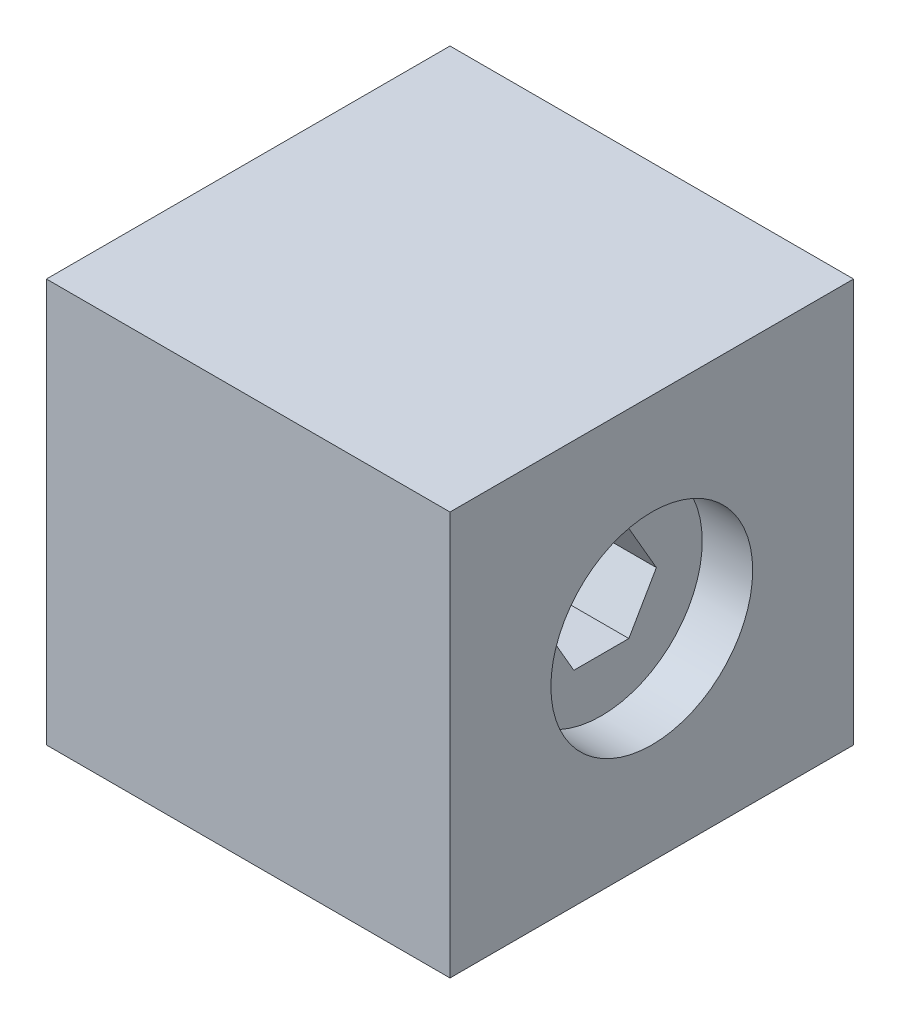
ISO-10303-21;
HEADER;
FILE_DESCRIPTION(('STEP AP214'),'2;1');
FILE_NAME('part.step','',(''),(''),'','','');
FILE_SCHEMA(('AUTOMOTIVE_DESIGN { 1 0 10303 214 1 1 1 1 }'));
ENDSEC;
DATA;
#1=APPLICATION_CONTEXT('core data for automotive mechanical design processes');
#2=APPLICATION_PROTOCOL_DEFINITION('international standard','automotive_design',2000,#1);
#3=PRODUCT_CONTEXT('',#1,'mechanical');
#4=PRODUCT('Part','Part','',(#3));
#5=PRODUCT_RELATED_PRODUCT_CATEGORY('part','',(#4));
#6=PRODUCT_DEFINITION_FORMATION('','',#4);
#7=PRODUCT_DEFINITION_CONTEXT('part definition',#1,'design');
#8=PRODUCT_DEFINITION('design','',#6,#7);
#9=PRODUCT_DEFINITION_SHAPE('','',#8);
#10=(LENGTH_UNIT() NAMED_UNIT(*) SI_UNIT(.MILLI.,.METRE.));
#11=(NAMED_UNIT(*) PLANE_ANGLE_UNIT() SI_UNIT($,.RADIAN.));
#12=(NAMED_UNIT(*) SI_UNIT($,.STERADIAN.) SOLID_ANGLE_UNIT());
#13=UNCERTAINTY_MEASURE_WITH_UNIT(LENGTH_MEASURE(1.E-05),#10,'distance_accuracy_value','');
#14=(GEOMETRIC_REPRESENTATION_CONTEXT(3) GLOBAL_UNCERTAINTY_ASSIGNED_CONTEXT((#13)) GLOBAL_UNIT_ASSIGNED_CONTEXT((#10,
#11,#12)) REPRESENTATION_CONTEXT('',''));
#15=CARTESIAN_POINT('',(0.,0.,0.));
#16=DIRECTION('',(0.,0.,1.));
#17=DIRECTION('',(1.,0.,0.));
#18=AXIS2_PLACEMENT_3D('',#15,#16,#17);
#19=CARTESIAN_POINT('',(-25.4,19.4,-3.46410161513776));
#20=DIRECTION('',(0.,-0.5,-0.866025403784438));
#21=DIRECTION('',(0.,0.866025403784439,-0.5));
#22=AXIS2_PLACEMENT_3D('',#19,#20,#21);
#23=PLANE('',#22);
#24=DIRECTION('',(0.,-0.866025403784439,0.5));
#25=VECTOR('',#24,1.);
#26=CARTESIAN_POINT('',(19.05,19.4,-3.46410161513776));
#27=LINE('',#26,#25);
#28=CARTESIAN_POINT('',(19.05,25.4,-6.92820323027552));
#29=VERTEX_POINT('',#28);
#30=CARTESIAN_POINT('',(19.05,19.4,-3.46410161513776));
#31=VERTEX_POINT('',#30);
#32=EDGE_CURVE('E158',#29,#31,#27,.T.);
#33=ORIENTED_EDGE('',*,*,#32,.F.);
#34=DIRECTION('',(1.,0.,0.));
#35=VECTOR('',#34,1.);
#36=CARTESIAN_POINT('',(-25.4,25.4,-6.92820323027552));
#37=LINE('',#36,#35);
#38=CARTESIAN_POINT('',(-25.4,25.4,-6.92820323027552));
#39=VERTEX_POINT('',#38);
#40=EDGE_CURVE('E165',#39,#29,#37,.T.);
#41=ORIENTED_EDGE('',*,*,#40,.F.);
#42=DIRECTION('',(0.,0.866025403784438,-0.5));
#43=VECTOR('',#42,1.);
#44=CARTESIAN_POINT('',(-25.4,19.4,-3.46410161513776));
#45=LINE('',#44,#43);
#46=CARTESIAN_POINT('',(-25.4,19.4,-3.46410161513776));
#47=VERTEX_POINT('',#46);
#48=EDGE_CURVE('E168',#47,#39,#45,.T.);
#49=ORIENTED_EDGE('',*,*,#48,.F.);
#50=DIRECTION('',(1.,0.,0.));
#51=VECTOR('',#50,1.);
#52=CARTESIAN_POINT('',(-25.4,19.4,-3.46410161513776));
#53=LINE('',#52,#51);
#54=EDGE_CURVE('E167',#47,#31,#53,.T.);
#55=ORIENTED_EDGE('',*,*,#54,.T.);
#56=EDGE_LOOP('',(#33,#41,#49,#55));
#57=FACE_BOUND('',#56,.T.);
#58=ADVANCED_FACE('F34',(#57),#23,.F.);
#59=CARTESIAN_POINT('',(-25.4,19.4,3.46410161513776));
#60=DIRECTION('',(0.,-1.,0.));
#61=DIRECTION('',(0.,0.,-1.));
#62=AXIS2_PLACEMENT_3D('',#59,#60,#61);
#63=PLANE('',#62);
#64=DIRECTION('',(0.,0.,1.));
#65=VECTOR('',#64,1.);
#66=CARTESIAN_POINT('',(19.05,19.4,3.46410161513776));
#67=LINE('',#66,#65);
#68=CARTESIAN_POINT('',(19.05,19.4,3.46410161513776));
#69=VERTEX_POINT('',#68);
#70=EDGE_CURVE('E169',#31,#69,#67,.T.);
#71=ORIENTED_EDGE('',*,*,#70,.F.);
#72=ORIENTED_EDGE('',*,*,#54,.F.);
#73=DIRECTION('',(0.,0.,-1.));
#74=VECTOR('',#73,1.);
#75=CARTESIAN_POINT('',(-25.4,19.4,3.46410161513776));
#76=LINE('',#75,#74);
#77=CARTESIAN_POINT('',(-25.4,19.4,3.46410161513776));
#78=VERTEX_POINT('',#77);
#79=EDGE_CURVE('E176',#78,#47,#76,.T.);
#80=ORIENTED_EDGE('',*,*,#79,.F.);
#81=DIRECTION('',(1.,0.,0.));
#82=VECTOR('',#81,1.);
#83=CARTESIAN_POINT('',(-25.4,19.4,3.46410161513776));
#84=LINE('',#83,#82);
#85=EDGE_CURVE('E553',#78,#69,#84,.T.);
#86=ORIENTED_EDGE('',*,*,#85,.T.);
#87=EDGE_LOOP('',(#71,#72,#80,#86));
#88=FACE_BOUND('',#87,.T.);
#89=ADVANCED_FACE('F311',(#88),#63,.F.);
#90=CARTESIAN_POINT('',(-25.4,25.4,6.92820323027552));
#91=DIRECTION('',(0.,-0.5,0.866025403784439));
#92=DIRECTION('',(0.,-0.866025403784439,-0.5));
#93=AXIS2_PLACEMENT_3D('',#90,#91,#92);
#94=PLANE('',#93);
#95=DIRECTION('',(0.,0.866025403784439,0.5));
#96=VECTOR('',#95,1.);
#97=CARTESIAN_POINT('',(19.05,25.4,6.92820323027552));
#98=LINE('',#97,#96);
#99=CARTESIAN_POINT('',(19.05,25.4,6.92820323027552));
#100=VERTEX_POINT('',#99);
#101=EDGE_CURVE('E541',#69,#100,#98,.T.);
#102=ORIENTED_EDGE('',*,*,#101,.F.);
#103=ORIENTED_EDGE('',*,*,#85,.F.);
#104=DIRECTION('',(0.,-0.866025403784439,-0.5));
#105=VECTOR('',#104,1.);
#106=CARTESIAN_POINT('',(-25.4,25.4,6.92820323027552));
#107=LINE('',#106,#105);
#108=CARTESIAN_POINT('',(-25.4,25.4,6.92820323027552));
#109=VERTEX_POINT('',#108);
#110=EDGE_CURVE('E181',#109,#78,#107,.T.);
#111=ORIENTED_EDGE('',*,*,#110,.F.);
#112=DIRECTION('',(1.,0.,0.));
#113=VECTOR('',#112,1.);
#114=CARTESIAN_POINT('',(-25.4,25.4,6.92820323027552));
#115=LINE('',#114,#113);
#116=EDGE_CURVE('E556',#109,#100,#115,.T.);
#117=ORIENTED_EDGE('',*,*,#116,.T.);
#118=EDGE_LOOP('',(#102,#103,#111,#117));
#119=FACE_BOUND('',#118,.T.);
#120=ADVANCED_FACE('F316',(#119),#94,.F.);
#121=CARTESIAN_POINT('',(-25.4,31.4,3.46410161513776));
#122=DIRECTION('',(0.,0.5,0.866025403784439));
#123=DIRECTION('',(0.,-0.866025403784439,0.5));
#124=AXIS2_PLACEMENT_3D('',#121,#122,#123);
#125=PLANE('',#124);
#126=DIRECTION('',(0.,0.866025403784439,-0.5));
#127=VECTOR('',#126,1.);
#128=CARTESIAN_POINT('',(19.05,31.4,3.46410161513776));
#129=LINE('',#128,#127);
#130=CARTESIAN_POINT('',(19.05,31.4,3.46410161513776));
#131=VERTEX_POINT('',#130);
#132=EDGE_CURVE('E539',#100,#131,#129,.T.);
#133=ORIENTED_EDGE('',*,*,#132,.F.);
#134=ORIENTED_EDGE('',*,*,#116,.F.);
#135=DIRECTION('',(0.,-0.866025403784439,0.5));
#136=VECTOR('',#135,1.);
#137=CARTESIAN_POINT('',(-25.4,31.4,3.46410161513776));
#138=LINE('',#137,#136);
#139=CARTESIAN_POINT('',(-25.4,31.4,3.46410161513776));
#140=VERTEX_POINT('',#139);
#141=EDGE_CURVE('E547',#140,#109,#138,.T.);
#142=ORIENTED_EDGE('',*,*,#141,.F.);
#143=DIRECTION('',(1.,0.,0.));
#144=VECTOR('',#143,1.);
#145=CARTESIAN_POINT('',(-25.4,31.4,3.46410161513776));
#146=LINE('',#145,#144);
#147=EDGE_CURVE('E178',#140,#131,#146,.T.);
#148=ORIENTED_EDGE('',*,*,#147,.T.);
#149=EDGE_LOOP('',(#133,#134,#142,#148));
#150=FACE_BOUND('',#149,.T.);
#151=ADVANCED_FACE('F444',(#150),#125,.F.);
#152=CARTESIAN_POINT('',(-25.4,31.4,-3.46410161513777));
#153=DIRECTION('',(0.,1.,0.));
#154=DIRECTION('',(0.,0.,1.));
#155=AXIS2_PLACEMENT_3D('',#152,#153,#154);
#156=PLANE('',#155);
#157=DIRECTION('',(0.,0.,-1.));
#158=VECTOR('',#157,1.);
#159=CARTESIAN_POINT('',(19.05,31.4,-3.46410161513777));
#160=LINE('',#159,#158);
#161=CARTESIAN_POINT('',(19.05,31.4,-3.46410161513777));
#162=VERTEX_POINT('',#161);
#163=EDGE_CURVE('E48',#131,#162,#160,.T.);
#164=ORIENTED_EDGE('',*,*,#163,.F.);
#165=ORIENTED_EDGE('',*,*,#147,.F.);
#166=DIRECTION('',(0.,0.,1.));
#167=VECTOR('',#166,1.);
#168=CARTESIAN_POINT('',(-25.4,31.4,-3.46410161513777));
#169=LINE('',#168,#167);
#170=CARTESIAN_POINT('',(-25.4,31.4,-3.46410161513776));
#171=VERTEX_POINT('',#170);
#172=EDGE_CURVE('E56',#171,#140,#169,.T.);
#173=ORIENTED_EDGE('',*,*,#172,.F.);
#174=DIRECTION('',(1.,0.,0.));
#175=VECTOR('',#174,1.);
#176=CARTESIAN_POINT('',(-25.4,31.4,-3.46410161513777));
#177=LINE('',#176,#175);
#178=EDGE_CURVE('E175',#171,#162,#177,.T.);
#179=ORIENTED_EDGE('',*,*,#178,.T.);
#180=EDGE_LOOP('',(#164,#165,#173,#179));
#181=FACE_BOUND('',#180,.T.);
#182=ADVANCED_FACE('F453',(#181),#156,.F.);
#183=CARTESIAN_POINT('',(-25.4,25.4,-6.92820323027552));
#184=DIRECTION('',(0.,0.5,-0.866025403784439));
#185=DIRECTION('',(0.,0.866025403784439,0.5));
#186=AXIS2_PLACEMENT_3D('',#183,#184,#185);
#187=PLANE('',#186);
#188=DIRECTION('',(0.,-0.866025403784439,-0.5));
#189=VECTOR('',#188,1.);
#190=CARTESIAN_POINT('',(19.05,25.4,-6.92820323027552));
#191=LINE('',#190,#189);
#192=EDGE_CURVE('E11',#162,#29,#191,.T.);
#193=ORIENTED_EDGE('',*,*,#192,.F.);
#194=ORIENTED_EDGE('',*,*,#178,.F.);
#195=DIRECTION('',(0.,0.866025403784439,0.5));
#196=VECTOR('',#195,1.);
#197=CARTESIAN_POINT('',(-25.4,25.4,-6.92820323027552));
#198=LINE('',#197,#196);
#199=EDGE_CURVE('E173',#39,#171,#198,.T.);
#200=ORIENTED_EDGE('',*,*,#199,.F.);
#201=ORIENTED_EDGE('',*,*,#40,.T.);
#202=EDGE_LOOP('',(#193,#194,#200,#201));
#203=FACE_BOUND('',#202,.T.);
#204=ADVANCED_FACE('F171',(#203),#187,.F.);
#205=CARTESIAN_POINT('',(25.4,50.8,25.4));
#206=DIRECTION('',(-1.,0.,0.));
#207=DIRECTION('',(0.,0.,1.));
#208=AXIS2_PLACEMENT_3D('',#205,#206,#207);
#209=PLANE('',#208);
#210=CARTESIAN_POINT('',(25.4,25.4,0.));
#211=DIRECTION('',(1.,0.,0.));
#212=DIRECTION('',(0.,0.,-1.));
#213=AXIS2_PLACEMENT_3D('',#210,#211,#212);
#214=CIRCLE('',#213,12.7);
#215=CARTESIAN_POINT('',(25.4,25.4,-12.7));
#216=VERTEX_POINT('',#215);
#217=EDGE_CURVE('E531',#216,#216,#214,.T.);
#218=ORIENTED_EDGE('',*,*,#217,.F.);
#219=EDGE_LOOP('',(#218));
#220=FACE_BOUND('',#219,.T.);
#221=DIRECTION('',(0.,0.,-1.));
#222=VECTOR('',#221,1.);
#223=CARTESIAN_POINT('',(25.4,0.,25.4));
#224=LINE('',#223,#222);
#225=CARTESIAN_POINT('',(25.4,0.,25.4));
#226=VERTEX_POINT('',#225);
#227=CARTESIAN_POINT('',(25.4,0.,-25.4));
#228=VERTEX_POINT('',#227);
#229=EDGE_CURVE('E244',#226,#228,#224,.T.);
#230=ORIENTED_EDGE('',*,*,#229,.T.);
#231=DIRECTION('',(0.,-1.,0.));
#232=VECTOR('',#231,1.);
#233=CARTESIAN_POINT('',(25.4,50.8,-25.4));
#234=LINE('',#233,#232);
#235=CARTESIAN_POINT('',(25.4,50.8,-25.4));
#236=VERTEX_POINT('',#235);
#237=EDGE_CURVE('E42',#236,#228,#234,.T.);
#238=ORIENTED_EDGE('',*,*,#237,.F.);
#239=DIRECTION('',(0.,0.,-1.));
#240=VECTOR('',#239,1.);
#241=CARTESIAN_POINT('',(25.4,50.8,25.4));
#242=LINE('',#241,#240);
#243=CARTESIAN_POINT('',(25.4,50.8,25.4));
#244=VERTEX_POINT('',#243);
#245=EDGE_CURVE('E251',#244,#236,#242,.T.);
#246=ORIENTED_EDGE('',*,*,#245,.F.);
#247=DIRECTION('',(0.,-1.,0.));
#248=VECTOR('',#247,1.);
#249=CARTESIAN_POINT('',(25.4,50.8,25.4));
#250=LINE('',#249,#248);
#251=EDGE_CURVE('E261',#244,#226,#250,.T.);
#252=ORIENTED_EDGE('',*,*,#251,.T.);
#253=EDGE_LOOP('',(#230,#238,#246,#252));
#254=FACE_BOUND('',#253,.T.);
#255=ADVANCED_FACE('F36',(#220,#254),#209,.F.);
#256=CARTESIAN_POINT('',(-25.4,50.8,-25.4));
#257=DIRECTION('',(0.,0.,1.));
#258=DIRECTION('',(1.,0.,0.));
#259=AXIS2_PLACEMENT_3D('',#256,#257,#258);
#260=PLANE('',#259);
#261=DIRECTION('',(-1.,0.,0.));
#262=VECTOR('',#261,1.);
#263=CARTESIAN_POINT('',(-25.4,0.,-25.4));
#264=LINE('',#263,#262);
#265=CARTESIAN_POINT('',(-25.4,0.,-25.4));
#266=VERTEX_POINT('',#265);
#267=EDGE_CURVE('E264',#228,#266,#264,.T.);
#268=ORIENTED_EDGE('',*,*,#267,.T.);
#269=DIRECTION('',(0.,-1.,0.));
#270=VECTOR('',#269,1.);
#271=CARTESIAN_POINT('',(-25.4,50.8,-25.4));
#272=LINE('',#271,#270);
#273=CARTESIAN_POINT('',(-25.4,50.8,-25.4));
#274=VERTEX_POINT('',#273);
#275=EDGE_CURVE('E274',#274,#266,#272,.T.);
#276=ORIENTED_EDGE('',*,*,#275,.F.);
#277=DIRECTION('',(-1.,0.,0.));
#278=VECTOR('',#277,1.);
#279=CARTESIAN_POINT('',(-25.4,50.8,-25.4));
#280=LINE('',#279,#278);
#281=EDGE_CURVE('E254',#236,#274,#280,.T.);
#282=ORIENTED_EDGE('',*,*,#281,.F.);
#283=ORIENTED_EDGE('',*,*,#237,.T.);
#284=EDGE_LOOP('',(#268,#276,#282,#283));
#285=FACE_BOUND('',#284,.T.);
#286=ADVANCED_FACE('F279',(#285),#260,.F.);
#287=CARTESIAN_POINT('',(-25.4,50.8,25.4));
#288=DIRECTION('',(1.,0.,0.));
#289=DIRECTION('',(0.,0.,-1.));
#290=AXIS2_PLACEMENT_3D('',#287,#288,#289);
#291=PLANE('',#290);
#292=ORIENTED_EDGE('',*,*,#79,.T.);
#293=ORIENTED_EDGE('',*,*,#48,.T.);
#294=ORIENTED_EDGE('',*,*,#199,.T.);
#295=ORIENTED_EDGE('',*,*,#172,.T.);
#296=ORIENTED_EDGE('',*,*,#141,.T.);
#297=ORIENTED_EDGE('',*,*,#110,.T.);
#298=EDGE_LOOP('',(#292,#293,#294,#295,#296,#297));
#299=FACE_BOUND('',#298,.T.);
#300=DIRECTION('',(0.,0.,1.));
#301=VECTOR('',#300,1.);
#302=CARTESIAN_POINT('',(-25.4,0.,25.4));
#303=LINE('',#302,#301);
#304=CARTESIAN_POINT('',(-25.4,0.,25.4));
#305=VERTEX_POINT('',#304);
#306=EDGE_CURVE('E266',#266,#305,#303,.T.);
#307=ORIENTED_EDGE('',*,*,#306,.T.);
#308=DIRECTION('',(0.,-1.,0.));
#309=VECTOR('',#308,1.);
#310=CARTESIAN_POINT('',(-25.4,50.8,25.4));
#311=LINE('',#310,#309);
#312=CARTESIAN_POINT('',(-25.4,50.8,25.4));
#313=VERTEX_POINT('',#312);
#314=EDGE_CURVE('E271',#313,#305,#311,.T.);
#315=ORIENTED_EDGE('',*,*,#314,.F.);
#316=DIRECTION('',(0.,0.,1.));
#317=VECTOR('',#316,1.);
#318=CARTESIAN_POINT('',(-25.4,50.8,25.4));
#319=LINE('',#318,#317);
#320=EDGE_CURVE('E257',#274,#313,#319,.T.);
#321=ORIENTED_EDGE('',*,*,#320,.F.);
#322=ORIENTED_EDGE('',*,*,#275,.T.);
#323=EDGE_LOOP('',(#307,#315,#321,#322));
#324=FACE_BOUND('',#323,.T.);
#325=ADVANCED_FACE('F291',(#299,#324),#291,.F.);
#326=CARTESIAN_POINT('',(-25.4,50.8,25.4));
#327=DIRECTION('',(0.,0.,-1.));
#328=DIRECTION('',(-1.,0.,0.));
#329=AXIS2_PLACEMENT_3D('',#326,#327,#328);
#330=PLANE('',#329);
#331=DIRECTION('',(1.,0.,0.));
#332=VECTOR('',#331,1.);
#333=CARTESIAN_POINT('',(-25.4,0.,25.4));
#334=LINE('',#333,#332);
#335=EDGE_CURVE('E255',#305,#226,#334,.T.);
#336=ORIENTED_EDGE('',*,*,#335,.T.);
#337=ORIENTED_EDGE('',*,*,#251,.F.);
#338=DIRECTION('',(1.,0.,0.));
#339=VECTOR('',#338,1.);
#340=CARTESIAN_POINT('',(-25.4,50.8,25.4));
#341=LINE('',#340,#339);
#342=EDGE_CURVE('E259',#313,#244,#341,.T.);
#343=ORIENTED_EDGE('',*,*,#342,.F.);
#344=ORIENTED_EDGE('',*,*,#314,.T.);
#345=EDGE_LOOP('',(#336,#337,#343,#344));
#346=FACE_BOUND('',#345,.T.);
#347=ADVANCED_FACE('F295',(#346),#330,.F.);
#348=CARTESIAN_POINT('',(0.,50.8,0.));
#349=DIRECTION('',(0.,-1.,0.));
#350=DIRECTION('',(0.,0.,-1.));
#351=AXIS2_PLACEMENT_3D('',#348,#349,#350);
#352=PLANE('',#351);
#353=ORIENTED_EDGE('',*,*,#245,.T.);
#354=ORIENTED_EDGE('',*,*,#281,.T.);
#355=ORIENTED_EDGE('',*,*,#320,.T.);
#356=ORIENTED_EDGE('',*,*,#342,.T.);
#357=EDGE_LOOP('',(#353,#354,#355,#356));
#358=FACE_BOUND('',#357,.T.);
#359=ADVANCED_FACE('F297',(#358),#352,.F.);
#360=CARTESIAN_POINT('',(0.,0.,0.));
#361=DIRECTION('',(0.,-1.,0.));
#362=DIRECTION('',(0.,0.,-1.));
#363=AXIS2_PLACEMENT_3D('',#360,#361,#362);
#364=PLANE('',#363);
#365=DIRECTION('',(0.,0.,1.));
#366=VECTOR('',#365,1.);
#367=CARTESIAN_POINT('',(12.7,0.,12.7));
#368=LINE('',#367,#366);
#369=CARTESIAN_POINT('',(12.7,0.,-12.7));
#370=VERTEX_POINT('',#369);
#371=CARTESIAN_POINT('',(12.7,0.,12.7));
#372=VERTEX_POINT('',#371);
#373=EDGE_CURVE('E212',#370,#372,#368,.T.);
#374=ORIENTED_EDGE('',*,*,#373,.F.);
#375=DIRECTION('',(1.,0.,0.));
#376=VECTOR('',#375,1.);
#377=CARTESIAN_POINT('',(-12.7,0.,-12.7));
#378=LINE('',#377,#376);
#379=CARTESIAN_POINT('',(-12.7,0.,-12.7));
#380=VERTEX_POINT('',#379);
#381=EDGE_CURVE('E223',#380,#370,#378,.T.);
#382=ORIENTED_EDGE('',*,*,#381,.F.);
#383=DIRECTION('',(0.,0.,-1.));
#384=VECTOR('',#383,1.);
#385=CARTESIAN_POINT('',(-12.7,0.,12.7));
#386=LINE('',#385,#384);
#387=CARTESIAN_POINT('',(-12.7,0.,12.7));
#388=VERTEX_POINT('',#387);
#389=EDGE_CURVE('E237',#388,#380,#386,.T.);
#390=ORIENTED_EDGE('',*,*,#389,.F.);
#391=DIRECTION('',(-1.,0.,0.));
#392=VECTOR('',#391,1.);
#393=CARTESIAN_POINT('',(-12.7,0.,12.7));
#394=LINE('',#393,#392);
#395=EDGE_CURVE('E234',#372,#388,#394,.T.);
#396=ORIENTED_EDGE('',*,*,#395,.F.);
#397=EDGE_LOOP('',(#374,#382,#390,#396));
#398=FACE_BOUND('',#397,.T.);
#399=ORIENTED_EDGE('',*,*,#229,.F.);
#400=ORIENTED_EDGE('',*,*,#335,.F.);
#401=ORIENTED_EDGE('',*,*,#306,.F.);
#402=ORIENTED_EDGE('',*,*,#267,.F.);
#403=EDGE_LOOP('',(#399,#400,#401,#402));
#404=FACE_BOUND('',#403,.T.);
#405=ADVANCED_FACE('F287',(#398,#404),#364,.T.);
#406=CARTESIAN_POINT('',(12.7,15.24,12.7));
#407=DIRECTION('',(1.,0.,0.));
#408=DIRECTION('',(0.,0.,-1.));
#409=AXIS2_PLACEMENT_3D('',#406,#407,#408);
#410=PLANE('',#409);
#411=ORIENTED_EDGE('',*,*,#373,.T.);
#412=DIRECTION('',(0.,-1.,0.));
#413=VECTOR('',#412,1.);
#414=CARTESIAN_POINT('',(12.7,15.24,12.7));
#415=LINE('',#414,#413);
#416=CARTESIAN_POINT('',(12.7,15.24,12.7));
#417=VERTEX_POINT('',#416);
#418=EDGE_CURVE('E232',#417,#372,#415,.T.);
#419=ORIENTED_EDGE('',*,*,#418,.F.);
#420=DIRECTION('',(0.,0.,1.));
#421=VECTOR('',#420,1.);
#422=CARTESIAN_POINT('',(12.7,15.24,12.7));
#423=LINE('',#422,#421);
#424=CARTESIAN_POINT('',(12.7,15.24,-12.7));
#425=VERTEX_POINT('',#424);
#426=EDGE_CURVE('E219',#425,#417,#423,.T.);
#427=ORIENTED_EDGE('',*,*,#426,.F.);
#428=DIRECTION('',(0.,-1.,0.));
#429=VECTOR('',#428,1.);
#430=CARTESIAN_POINT('',(12.7,15.24,-12.7));
#431=LINE('',#430,#429);
#432=EDGE_CURVE('E242',#425,#370,#431,.T.);
#433=ORIENTED_EDGE('',*,*,#432,.T.);
#434=EDGE_LOOP('',(#411,#419,#427,#433));
#435=FACE_BOUND('',#434,.T.);
#436=ADVANCED_FACE('F304',(#435),#410,.F.);
#437=CARTESIAN_POINT('',(-12.7,15.24,-12.7));
#438=DIRECTION('',(0.,0.,-1.));
#439=DIRECTION('',(-1.,0.,0.));
#440=AXIS2_PLACEMENT_3D('',#437,#438,#439);
#441=PLANE('',#440);
#442=ORIENTED_EDGE('',*,*,#381,.T.);
#443=ORIENTED_EDGE('',*,*,#432,.F.);
#444=DIRECTION('',(1.,0.,0.));
#445=VECTOR('',#444,1.);
#446=CARTESIAN_POINT('',(-12.7,15.24,-12.7));
#447=LINE('',#446,#445);
#448=CARTESIAN_POINT('',(-12.7,15.24,-12.7));
#449=VERTEX_POINT('',#448);
#450=EDGE_CURVE('E229',#449,#425,#447,.T.);
#451=ORIENTED_EDGE('',*,*,#450,.F.);
#452=DIRECTION('',(0.,-1.,0.));
#453=VECTOR('',#452,1.);
#454=CARTESIAN_POINT('',(-12.7,15.24,-12.7));
#455=LINE('',#454,#453);
#456=EDGE_CURVE('E245',#449,#380,#455,.T.);
#457=ORIENTED_EDGE('',*,*,#456,.T.);
#458=EDGE_LOOP('',(#442,#443,#451,#457));
#459=FACE_BOUND('',#458,.T.);
#460=ADVANCED_FACE('F343',(#459),#441,.F.);
#461=CARTESIAN_POINT('',(-12.7,15.24,12.7));
#462=DIRECTION('',(-1.,0.,0.));
#463=DIRECTION('',(0.,0.,1.));
#464=AXIS2_PLACEMENT_3D('',#461,#462,#463);
#465=PLANE('',#464);
#466=ORIENTED_EDGE('',*,*,#389,.T.);
#467=ORIENTED_EDGE('',*,*,#456,.F.);
#468=DIRECTION('',(0.,0.,-1.));
#469=VECTOR('',#468,1.);
#470=CARTESIAN_POINT('',(-12.7,15.24,12.7));
#471=LINE('',#470,#469);
#472=CARTESIAN_POINT('',(-12.7,15.24,12.7));
#473=VERTEX_POINT('',#472);
#474=EDGE_CURVE('E226',#473,#449,#471,.T.);
#475=ORIENTED_EDGE('',*,*,#474,.F.);
#476=DIRECTION('',(0.,-1.,0.));
#477=VECTOR('',#476,1.);
#478=CARTESIAN_POINT('',(-12.7,15.24,12.7));
#479=LINE('',#478,#477);
#480=EDGE_CURVE('E247',#473,#388,#479,.T.);
#481=ORIENTED_EDGE('',*,*,#480,.T.);
#482=EDGE_LOOP('',(#466,#467,#475,#481));
#483=FACE_BOUND('',#482,.T.);
#484=ADVANCED_FACE('F346',(#483),#465,.F.);
#485=CARTESIAN_POINT('',(-12.7,15.24,12.7));
#486=DIRECTION('',(0.,0.,1.));
#487=DIRECTION('',(1.,0.,0.));
#488=AXIS2_PLACEMENT_3D('',#485,#486,#487);
#489=PLANE('',#488);
#490=ORIENTED_EDGE('',*,*,#395,.T.);
#491=ORIENTED_EDGE('',*,*,#480,.F.);
#492=DIRECTION('',(-1.,0.,0.));
#493=VECTOR('',#492,1.);
#494=CARTESIAN_POINT('',(-12.7,15.24,12.7));
#495=LINE('',#494,#493);
#496=EDGE_CURVE('E222',#417,#473,#495,.T.);
#497=ORIENTED_EDGE('',*,*,#496,.F.);
#498=ORIENTED_EDGE('',*,*,#418,.T.);
#499=EDGE_LOOP('',(#490,#491,#497,#498));
#500=FACE_BOUND('',#499,.T.);
#501=ADVANCED_FACE('F341',(#500),#489,.F.);
#502=CARTESIAN_POINT('',(0.,15.24,0.));
#503=DIRECTION('',(0.,-1.,0.));
#504=DIRECTION('',(0.,0.,-1.));
#505=AXIS2_PLACEMENT_3D('',#502,#503,#504);
#506=PLANE('',#505);
#507=DIRECTION('',(1.,0.,0.));
#508=VECTOR('',#507,1.);
#509=CARTESIAN_POINT('',(-11.176,15.24,-11.176));
#510=LINE('',#509,#508);
#511=CARTESIAN_POINT('',(-11.176,15.24,-11.176));
#512=VERTEX_POINT('',#511);
#513=CARTESIAN_POINT('',(11.176,15.24,-11.176));
#514=VERTEX_POINT('',#513);
#515=EDGE_CURVE('E195',#512,#514,#510,.T.);
#516=ORIENTED_EDGE('',*,*,#515,.F.);
#517=DIRECTION('',(0.,0.,-1.));
#518=VECTOR('',#517,1.);
#519=CARTESIAN_POINT('',(-11.176,15.24,11.176));
#520=LINE('',#519,#518);
#521=CARTESIAN_POINT('',(-11.176,15.24,11.176));
#522=VERTEX_POINT('',#521);
#523=EDGE_CURVE('E192',#522,#512,#520,.T.);
#524=ORIENTED_EDGE('',*,*,#523,.F.);
#525=DIRECTION('',(-1.,0.,0.));
#526=VECTOR('',#525,1.);
#527=CARTESIAN_POINT('',(-11.176,15.24,11.176));
#528=LINE('',#527,#526);
#529=CARTESIAN_POINT('',(11.176,15.24,11.176));
#530=VERTEX_POINT('',#529);
#531=EDGE_CURVE('E188',#530,#522,#528,.T.);
#532=ORIENTED_EDGE('',*,*,#531,.F.);
#533=DIRECTION('',(0.,0.,1.));
#534=VECTOR('',#533,1.);
#535=CARTESIAN_POINT('',(11.176,15.24,11.176));
#536=LINE('',#535,#534);
#537=EDGE_CURVE('E185',#514,#530,#536,.T.);
#538=ORIENTED_EDGE('',*,*,#537,.F.);
#539=EDGE_LOOP('',(#516,#524,#532,#538));
#540=FACE_BOUND('',#539,.T.);
#541=ORIENTED_EDGE('',*,*,#426,.T.);
#542=ORIENTED_EDGE('',*,*,#496,.T.);
#543=ORIENTED_EDGE('',*,*,#474,.T.);
#544=ORIENTED_EDGE('',*,*,#450,.T.);
#545=EDGE_LOOP('',(#541,#542,#543,#544));
#546=FACE_BOUND('',#545,.T.);
#547=ADVANCED_FACE('F337',(#540,#546),#506,.T.);
#548=CARTESIAN_POINT('',(11.176,15.24,11.176));
#549=DIRECTION('',(1.,0.,0.));
#550=DIRECTION('',(0.,0.,-1.));
#551=AXIS2_PLACEMENT_3D('',#548,#549,#550);
#552=PLANE('',#551);
#553=DIRECTION('',(0.,0.,1.));
#554=VECTOR('',#553,1.);
#555=CARTESIAN_POINT('',(11.176,0.,11.176));
#556=LINE('',#555,#554);
#557=CARTESIAN_POINT('',(11.176,0.,-11.176));
#558=VERTEX_POINT('',#557);
#559=CARTESIAN_POINT('',(11.176,0.,11.176));
#560=VERTEX_POINT('',#559);
#561=EDGE_CURVE('E199',#558,#560,#556,.T.);
#562=ORIENTED_EDGE('',*,*,#561,.F.);
#563=DIRECTION('',(0.,-1.,0.));
#564=VECTOR('',#563,1.);
#565=CARTESIAN_POINT('',(11.176,15.24,-11.176));
#566=LINE('',#565,#564);
#567=EDGE_CURVE('E210',#514,#558,#566,.T.);
#568=ORIENTED_EDGE('',*,*,#567,.F.);
#569=ORIENTED_EDGE('',*,*,#537,.T.);
#570=DIRECTION('',(0.,-1.,0.));
#571=VECTOR('',#570,1.);
#572=CARTESIAN_POINT('',(11.176,15.24,11.176));
#573=LINE('',#572,#571);
#574=EDGE_CURVE('E198',#530,#560,#573,.T.);
#575=ORIENTED_EDGE('',*,*,#574,.T.);
#576=EDGE_LOOP('',(#562,#568,#569,#575));
#577=FACE_BOUND('',#576,.T.);
#578=ADVANCED_FACE('F326',(#577),#552,.T.);
#579=CARTESIAN_POINT('',(-11.176,15.24,-11.176));
#580=DIRECTION('',(0.,0.,-1.));
#581=DIRECTION('',(-1.,0.,0.));
#582=AXIS2_PLACEMENT_3D('',#579,#580,#581);
#583=PLANE('',#582);
#584=DIRECTION('',(1.,0.,0.));
#585=VECTOR('',#584,1.);
#586=CARTESIAN_POINT('',(-11.176,0.,-11.176));
#587=LINE('',#586,#585);
#588=CARTESIAN_POINT('',(-11.176,0.,-11.176));
#589=VERTEX_POINT('',#588);
#590=EDGE_CURVE('E189',#589,#558,#587,.T.);
#591=ORIENTED_EDGE('',*,*,#590,.F.);
#592=DIRECTION('',(0.,-1.,0.));
#593=VECTOR('',#592,1.);
#594=CARTESIAN_POINT('',(-11.176,15.24,-11.176));
#595=LINE('',#594,#593);
#596=EDGE_CURVE('E213',#512,#589,#595,.T.);
#597=ORIENTED_EDGE('',*,*,#596,.F.);
#598=ORIENTED_EDGE('',*,*,#515,.T.);
#599=ORIENTED_EDGE('',*,*,#567,.T.);
#600=EDGE_LOOP('',(#591,#597,#598,#599));
#601=FACE_BOUND('',#600,.T.);
#602=ADVANCED_FACE('F322',(#601),#583,.T.);
#603=CARTESIAN_POINT('',(-11.176,15.24,11.176));
#604=DIRECTION('',(-1.,0.,0.));
#605=DIRECTION('',(0.,0.,1.));
#606=AXIS2_PLACEMENT_3D('',#603,#604,#605);
#607=PLANE('',#606);
#608=DIRECTION('',(0.,0.,-1.));
#609=VECTOR('',#608,1.);
#610=CARTESIAN_POINT('',(-11.176,0.,11.176));
#611=LINE('',#610,#609);
#612=CARTESIAN_POINT('',(-11.176,0.,11.176));
#613=VERTEX_POINT('',#612);
#614=EDGE_CURVE('E205',#613,#589,#611,.T.);
#615=ORIENTED_EDGE('',*,*,#614,.F.);
#616=DIRECTION('',(0.,-1.,0.));
#617=VECTOR('',#616,1.);
#618=CARTESIAN_POINT('',(-11.176,15.24,11.176));
#619=LINE('',#618,#617);
#620=EDGE_CURVE('E215',#522,#613,#619,.T.);
#621=ORIENTED_EDGE('',*,*,#620,.F.);
#622=ORIENTED_EDGE('',*,*,#523,.T.);
#623=ORIENTED_EDGE('',*,*,#596,.T.);
#624=EDGE_LOOP('',(#615,#621,#622,#623));
#625=FACE_BOUND('',#624,.T.);
#626=ADVANCED_FACE('F325',(#625),#607,.T.);
#627=CARTESIAN_POINT('',(-11.176,15.24,11.176));
#628=DIRECTION('',(0.,0.,1.));
#629=DIRECTION('',(1.,0.,0.));
#630=AXIS2_PLACEMENT_3D('',#627,#628,#629);
#631=PLANE('',#630);
#632=DIRECTION('',(-1.,0.,0.));
#633=VECTOR('',#632,1.);
#634=CARTESIAN_POINT('',(-11.176,0.,11.176));
#635=LINE('',#634,#633);
#636=EDGE_CURVE('E202',#560,#613,#635,.T.);
#637=ORIENTED_EDGE('',*,*,#636,.F.);
#638=ORIENTED_EDGE('',*,*,#574,.F.);
#639=ORIENTED_EDGE('',*,*,#531,.T.);
#640=ORIENTED_EDGE('',*,*,#620,.T.);
#641=EDGE_LOOP('',(#637,#638,#639,#640));
#642=FACE_BOUND('',#641,.T.);
#643=ADVANCED_FACE('F330',(#642),#631,.T.);
#644=ORIENTED_EDGE('',*,*,#590,.T.);
#645=ORIENTED_EDGE('',*,*,#561,.T.);
#646=ORIENTED_EDGE('',*,*,#636,.T.);
#647=ORIENTED_EDGE('',*,*,#614,.T.);
#648=EDGE_LOOP('',(#644,#645,#646,#647));
#649=FACE_BOUND('',#648,.T.);
#650=ADVANCED_FACE('F307',(#649),#364,.T.);
#651=CARTESIAN_POINT('',(19.05,25.4,0.));
#652=DIRECTION('',(1.,0.,0.));
#653=DIRECTION('',(0.,0.,-1.));
#654=AXIS2_PLACEMENT_3D('',#651,#652,#653);
#655=PLANE('',#654);
#656=CARTESIAN_POINT('',(19.05,25.4,0.));
#657=DIRECTION('',(1.,0.,0.));
#658=DIRECTION('',(0.,0.,-1.));
#659=AXIS2_PLACEMENT_3D('',#656,#657,#658);
#660=CIRCLE('',#659,12.7);
#661=CARTESIAN_POINT('',(19.05,25.4,-12.7));
#662=VERTEX_POINT('',#661);
#663=EDGE_CURVE('E533',#662,#662,#660,.T.);
#664=ORIENTED_EDGE('',*,*,#663,.T.);
#665=EDGE_LOOP('',(#664));
#666=FACE_BOUND('',#665,.T.);
#667=ORIENTED_EDGE('',*,*,#32,.T.);
#668=ORIENTED_EDGE('',*,*,#70,.T.);
#669=ORIENTED_EDGE('',*,*,#101,.T.);
#670=ORIENTED_EDGE('',*,*,#132,.T.);
#671=ORIENTED_EDGE('',*,*,#163,.T.);
#672=ORIENTED_EDGE('',*,*,#192,.T.);
#673=EDGE_LOOP('',(#667,#668,#669,#670,#671,#672));
#674=FACE_BOUND('',#673,.T.);
#675=ADVANCED_FACE('F157',(#666,#674),#655,.T.);
#676=CARTESIAN_POINT('',(19.05,25.4,0.));
#677=DIRECTION('',(1.,0.,0.));
#678=DIRECTION('',(0.,0.,-1.));
#679=AXIS2_PLACEMENT_3D('',#676,#677,#678);
#680=CYLINDRICAL_SURFACE('',#679,12.7);
#681=ORIENTED_EDGE('',*,*,#663,.F.);
#682=EDGE_LOOP('',(#681));
#683=FACE_BOUND('',#682,.T.);
#684=ORIENTED_EDGE('',*,*,#217,.T.);
#685=EDGE_LOOP('',(#684));
#686=FACE_BOUND('',#685,.T.);
#687=ADVANCED_FACE('F413',(#683,#686),#680,.F.);
#688=CLOSED_SHELL('',(#58,#89,#120,#151,#182,#204,#255,#286,#325,#347,#359,#405,#436,#460,#484,
#501,#547,#578,#602,#626,#643,#650,#675,#687));
#689=MANIFOLD_SOLID_BREP('B2',#688);
#690=ADVANCED_BREP_SHAPE_REPRESENTATION('',(#18,#689),#14);
#691=SHAPE_DEFINITION_REPRESENTATION(#9,#690);
ENDSEC;
END-ISO-10303-21;
